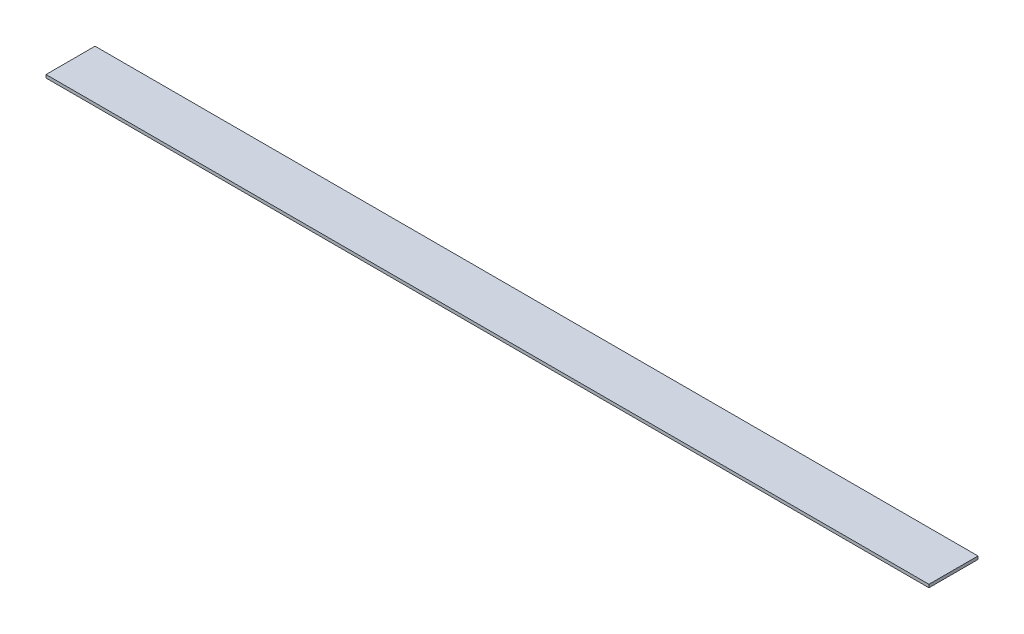
ISO-10303-21;
HEADER;
FILE_DESCRIPTION(('STEP AP214'),'2;1');
FILE_NAME('part.step','',(''),(''),'','','');
FILE_SCHEMA(('AUTOMOTIVE_DESIGN { 1 0 10303 214 1 1 1 1 }'));
ENDSEC;
DATA;
#1=APPLICATION_CONTEXT('core data for automotive mechanical design processes');
#2=APPLICATION_PROTOCOL_DEFINITION('international standard','automotive_design',2000,#1);
#3=PRODUCT_CONTEXT('',#1,'mechanical');
#4=PRODUCT('Part','Part','',(#3));
#5=PRODUCT_RELATED_PRODUCT_CATEGORY('part','',(#4));
#6=PRODUCT_DEFINITION_FORMATION('','',#4);
#7=PRODUCT_DEFINITION_CONTEXT('part definition',#1,'design');
#8=PRODUCT_DEFINITION('design','',#6,#7);
#9=PRODUCT_DEFINITION_SHAPE('','',#8);
#10=(LENGTH_UNIT() NAMED_UNIT(*) SI_UNIT(.MILLI.,.METRE.));
#11=(NAMED_UNIT(*) PLANE_ANGLE_UNIT() SI_UNIT($,.RADIAN.));
#12=(NAMED_UNIT(*) SI_UNIT($,.STERADIAN.) SOLID_ANGLE_UNIT());
#13=UNCERTAINTY_MEASURE_WITH_UNIT(LENGTH_MEASURE(1.E-05),#10,'distance_accuracy_value','');
#14=(GEOMETRIC_REPRESENTATION_CONTEXT(3) GLOBAL_UNCERTAINTY_ASSIGNED_CONTEXT((#13)) GLOBAL_UNIT_ASSIGNED_CONTEXT((#10,
#11,#12)) REPRESENTATION_CONTEXT('',''));
#15=CARTESIAN_POINT('',(0.,0.,0.));
#16=DIRECTION('',(0.,0.,1.));
#17=DIRECTION('',(1.,0.,0.));
#18=AXIS2_PLACEMENT_3D('',#15,#16,#17);
#19=CARTESIAN_POINT('',(-457.2,3.175,-25.3999999999999));
#20=DIRECTION('',(1.,0.,0.));
#21=DIRECTION('',(0.,0.,-1.));
#22=AXIS2_PLACEMENT_3D('',#19,#20,#21);
#23=PLANE('',#22);
#24=DIRECTION('',(0.,0.,1.));
#25=VECTOR('',#24,1.);
#26=CARTESIAN_POINT('',(-457.2,0.,-25.3999999999999));
#27=LINE('',#26,#25);
#28=CARTESIAN_POINT('',(-457.2,0.,-25.3999999999999));
#29=VERTEX_POINT('',#28);
#30=CARTESIAN_POINT('',(-457.2,0.,25.4000000000001));
#31=VERTEX_POINT('',#30);
#32=EDGE_CURVE('E95',#29,#31,#27,.T.);
#33=ORIENTED_EDGE('',*,*,#32,.T.);
#34=DIRECTION('',(0.,-1.,0.));
#35=VECTOR('',#34,1.);
#36=CARTESIAN_POINT('',(-457.2,3.175,25.4000000000001));
#37=LINE('',#36,#35);
#38=CARTESIAN_POINT('',(-457.2,3.175,25.4000000000001));
#39=VERTEX_POINT('',#38);
#40=EDGE_CURVE('E11',#39,#31,#37,.T.);
#41=ORIENTED_EDGE('',*,*,#40,.F.);
#42=DIRECTION('',(0.,0.,1.));
#43=VECTOR('',#42,1.);
#44=CARTESIAN_POINT('',(-457.2,3.175,-25.3999999999999));
#45=LINE('',#44,#43);
#46=CARTESIAN_POINT('',(-457.2,3.175,-25.3999999999999));
#47=VERTEX_POINT('',#46);
#48=EDGE_CURVE('E83',#47,#39,#45,.T.);
#49=ORIENTED_EDGE('',*,*,#48,.F.);
#50=DIRECTION('',(0.,-1.,0.));
#51=VECTOR('',#50,1.);
#52=CARTESIAN_POINT('',(-457.2,3.175,-25.3999999999999));
#53=LINE('',#52,#51);
#54=EDGE_CURVE('E91',#47,#29,#53,.T.);
#55=ORIENTED_EDGE('',*,*,#54,.T.);
#56=EDGE_LOOP('',(#33,#41,#49,#55));
#57=FACE_BOUND('',#56,.T.);
#58=ADVANCED_FACE('F32',(#57),#23,.F.);
#59=CARTESIAN_POINT('',(457.2,3.175,25.3999999999999));
#60=DIRECTION('',(0.,0.,-1.));
#61=DIRECTION('',(-1.,0.,0.));
#62=AXIS2_PLACEMENT_3D('',#59,#60,#61);
#63=PLANE('',#62);
#64=DIRECTION('',(1.,0.,0.));
#65=VECTOR('',#64,1.);
#66=CARTESIAN_POINT('',(457.2,0.,25.3999999999999));
#67=LINE('',#66,#65);
#68=CARTESIAN_POINT('',(457.2,0.,25.3999999999999));
#69=VERTEX_POINT('',#68);
#70=EDGE_CURVE('E87',#31,#69,#67,.T.);
#71=ORIENTED_EDGE('',*,*,#70,.T.);
#72=DIRECTION('',(0.,-1.,0.));
#73=VECTOR('',#72,1.);
#74=CARTESIAN_POINT('',(457.2,3.175,25.3999999999999));
#75=LINE('',#74,#73);
#76=CARTESIAN_POINT('',(457.2,3.175,25.3999999999999));
#77=VERTEX_POINT('',#76);
#78=EDGE_CURVE('E40',#77,#69,#75,.T.);
#79=ORIENTED_EDGE('',*,*,#78,.F.);
#80=DIRECTION('',(1.,0.,0.));
#81=VECTOR('',#80,1.);
#82=CARTESIAN_POINT('',(457.2,3.175,25.3999999999999));
#83=LINE('',#82,#81);
#84=EDGE_CURVE('E78',#39,#77,#83,.T.);
#85=ORIENTED_EDGE('',*,*,#84,.F.);
#86=ORIENTED_EDGE('',*,*,#40,.T.);
#87=EDGE_LOOP('',(#71,#79,#85,#86));
#88=FACE_BOUND('',#87,.T.);
#89=ADVANCED_FACE('F86',(#88),#63,.F.);
#90=CARTESIAN_POINT('',(457.2,3.175,-25.4));
#91=DIRECTION('',(-1.,0.,0.));
#92=DIRECTION('',(0.,0.,1.));
#93=AXIS2_PLACEMENT_3D('',#90,#91,#92);
#94=PLANE('',#93);
#95=DIRECTION('',(0.,0.,-1.));
#96=VECTOR('',#95,1.);
#97=CARTESIAN_POINT('',(457.2,0.,-25.4));
#98=LINE('',#97,#96);
#99=CARTESIAN_POINT('',(457.2,0.,-25.4));
#100=VERTEX_POINT('',#99);
#101=EDGE_CURVE('E65',#69,#100,#98,.T.);
#102=ORIENTED_EDGE('',*,*,#101,.T.);
#103=DIRECTION('',(0.,-1.,0.));
#104=VECTOR('',#103,1.);
#105=CARTESIAN_POINT('',(457.2,3.175,-25.4));
#106=LINE('',#105,#104);
#107=CARTESIAN_POINT('',(457.2,3.175,-25.4));
#108=VERTEX_POINT('',#107);
#109=EDGE_CURVE('E88',#108,#100,#106,.T.);
#110=ORIENTED_EDGE('',*,*,#109,.F.);
#111=DIRECTION('',(0.,0.,-1.));
#112=VECTOR('',#111,1.);
#113=CARTESIAN_POINT('',(457.2,3.175,-25.4));
#114=LINE('',#113,#112);
#115=EDGE_CURVE('E81',#77,#108,#114,.T.);
#116=ORIENTED_EDGE('',*,*,#115,.F.);
#117=ORIENTED_EDGE('',*,*,#78,.T.);
#118=EDGE_LOOP('',(#102,#110,#116,#117));
#119=FACE_BOUND('',#118,.T.);
#120=ADVANCED_FACE('F89',(#119),#94,.F.);
#121=CARTESIAN_POINT('',(457.2,3.175,-25.4));
#122=DIRECTION('',(0.,0.,1.));
#123=DIRECTION('',(1.,0.,0.));
#124=AXIS2_PLACEMENT_3D('',#121,#122,#123);
#125=PLANE('',#124);
#126=DIRECTION('',(-1.,0.,0.));
#127=VECTOR('',#126,1.);
#128=CARTESIAN_POINT('',(457.2,0.,-25.4));
#129=LINE('',#128,#127);
#130=EDGE_CURVE('E71',#100,#29,#129,.T.);
#131=ORIENTED_EDGE('',*,*,#130,.T.);
#132=ORIENTED_EDGE('',*,*,#54,.F.);
#133=DIRECTION('',(-1.,0.,0.));
#134=VECTOR('',#133,1.);
#135=CARTESIAN_POINT('',(457.2,3.175,-25.4));
#136=LINE('',#135,#134);
#137=EDGE_CURVE('E48',#108,#47,#136,.T.);
#138=ORIENTED_EDGE('',*,*,#137,.F.);
#139=ORIENTED_EDGE('',*,*,#109,.T.);
#140=EDGE_LOOP('',(#131,#132,#138,#139));
#141=FACE_BOUND('',#140,.T.);
#142=ADVANCED_FACE('F102',(#141),#125,.F.);
#143=CARTESIAN_POINT('',(0.,3.175,0.));
#144=DIRECTION('',(0.,-1.,0.));
#145=DIRECTION('',(0.,0.,-1.));
#146=AXIS2_PLACEMENT_3D('',#143,#144,#145);
#147=PLANE('',#146);
#148=ORIENTED_EDGE('',*,*,#48,.T.);
#149=ORIENTED_EDGE('',*,*,#84,.T.);
#150=ORIENTED_EDGE('',*,*,#115,.T.);
#151=ORIENTED_EDGE('',*,*,#137,.T.);
#152=EDGE_LOOP('',(#148,#149,#150,#151));
#153=FACE_BOUND('',#152,.T.);
#154=ADVANCED_FACE('F79',(#153),#147,.F.);
#155=CARTESIAN_POINT('',(0.,0.,0.));
#156=DIRECTION('',(0.,-1.,0.));
#157=DIRECTION('',(0.,0.,-1.));
#158=AXIS2_PLACEMENT_3D('',#155,#156,#157);
#159=PLANE('',#158);
#160=ORIENTED_EDGE('',*,*,#32,.F.);
#161=ORIENTED_EDGE('',*,*,#130,.F.);
#162=ORIENTED_EDGE('',*,*,#101,.F.);
#163=ORIENTED_EDGE('',*,*,#70,.F.);
#164=EDGE_LOOP('',(#160,#161,#162,#163));
#165=FACE_BOUND('',#164,.T.);
#166=ADVANCED_FACE('F105',(#165),#159,.T.);
#167=CLOSED_SHELL('',(#58,#89,#120,#142,#154,#166));
#168=MANIFOLD_SOLID_BREP('B2',#167);
#169=ADVANCED_BREP_SHAPE_REPRESENTATION('',(#18,#168),#14);
#170=SHAPE_DEFINITION_REPRESENTATION(#9,#169);
ENDSEC;
END-ISO-10303-21;
